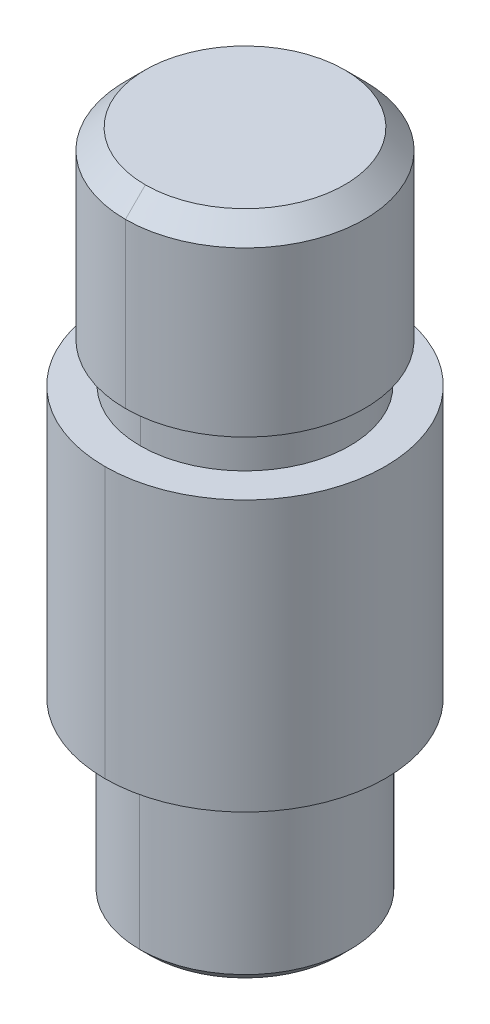
ISO-10303-21;
HEADER;
FILE_DESCRIPTION(('STEP AP214'),'2;1');
FILE_NAME('part.step','',(''),(''),'','','');
FILE_SCHEMA(('AUTOMOTIVE_DESIGN { 1 0 10303 214 1 1 1 1 }'));
ENDSEC;
DATA;
#1=APPLICATION_CONTEXT('core data for automotive mechanical design processes');
#2=APPLICATION_PROTOCOL_DEFINITION('international standard','automotive_design',2000,#1);
#3=PRODUCT_CONTEXT('',#1,'mechanical');
#4=PRODUCT('Part','Part','',(#3));
#5=PRODUCT_RELATED_PRODUCT_CATEGORY('part','',(#4));
#6=PRODUCT_DEFINITION_FORMATION('','',#4);
#7=PRODUCT_DEFINITION_CONTEXT('part definition',#1,'design');
#8=PRODUCT_DEFINITION('design','',#6,#7);
#9=PRODUCT_DEFINITION_SHAPE('','',#8);
#10=(LENGTH_UNIT() NAMED_UNIT(*) SI_UNIT(.MILLI.,.METRE.));
#11=(NAMED_UNIT(*) PLANE_ANGLE_UNIT() SI_UNIT($,.RADIAN.));
#12=(NAMED_UNIT(*) SI_UNIT($,.STERADIAN.) SOLID_ANGLE_UNIT());
#13=UNCERTAINTY_MEASURE_WITH_UNIT(LENGTH_MEASURE(1.E-05),#10,'distance_accuracy_value','');
#14=(GEOMETRIC_REPRESENTATION_CONTEXT(3) GLOBAL_UNCERTAINTY_ASSIGNED_CONTEXT((#13)) GLOBAL_UNIT_ASSIGNED_CONTEXT((#10,
#11,#12)) REPRESENTATION_CONTEXT('',''));
#15=CARTESIAN_POINT('',(0.,0.,0.));
#16=DIRECTION('',(0.,0.,1.));
#17=DIRECTION('',(1.,0.,0.));
#18=AXIS2_PLACEMENT_3D('',#15,#16,#17);
#19=CARTESIAN_POINT('',(0.,22.3865327371101,0.));
#20=DIRECTION('',(0.,1.,0.));
#21=DIRECTION('',(0.,0.,1.));
#22=AXIS2_PLACEMENT_3D('',#19,#20,#21);
#23=CYLINDRICAL_SURFACE('',#22,3.49999999999727);
#24=CARTESIAN_POINT('',(0.,14.9075247376742,0.));
#25=DIRECTION('',(0.,1.,0.));
#26=DIRECTION('',(0.,0.,1.));
#27=AXIS2_PLACEMENT_3D('',#24,#25,#26);
#28=CIRCLE('',#27,3.49999999999727);
#29=CARTESIAN_POINT('',(0.,14.9075247376742,3.49999999999727));
#30=VERTEX_POINT('',#29);
#31=CARTESIAN_POINT('',(0.,14.9075247376742,-3.49999999999727));
#32=VERTEX_POINT('',#31);
#33=EDGE_CURVE('E11',#30,#32,#28,.T.);
#34=ORIENTED_EDGE('',*,*,#33,.T.);
#35=DIRECTION('',(0.,1.,0.));
#36=VECTOR('',#35,1.);
#37=CARTESIAN_POINT('',(0.,22.3865327371101,-3.49999999999727));
#38=LINE('',#37,#36);
#39=CARTESIAN_POINT('',(0.,16.2408580710061,-3.49999999999727));
#40=VERTEX_POINT('',#39);
#41=EDGE_CURVE('E27',#32,#40,#38,.T.);
#42=ORIENTED_EDGE('',*,*,#41,.T.);
#43=CARTESIAN_POINT('',(0.,16.2408580710061,0.));
#44=DIRECTION('',(0.,1.,0.));
#45=DIRECTION('',(0.,0.,1.));
#46=AXIS2_PLACEMENT_3D('',#43,#44,#45);
#47=CIRCLE('',#46,3.49999999999727);
#48=CARTESIAN_POINT('',(0.,16.2408580710061,3.49999999999727));
#49=VERTEX_POINT('',#48);
#50=EDGE_CURVE('E180',#49,#40,#47,.T.);
#51=ORIENTED_EDGE('',*,*,#50,.F.);
#52=DIRECTION('',(0.,1.,0.));
#53=VECTOR('',#52,1.);
#54=CARTESIAN_POINT('',(0.,22.3865327371101,3.49999999999727));
#55=LINE('',#54,#53);
#56=EDGE_CURVE('E184',#30,#49,#55,.T.);
#57=ORIENTED_EDGE('',*,*,#56,.F.);
#58=EDGE_LOOP('',(#34,#42,#51,#57));
#59=FACE_BOUND('',#58,.T.);
#60=ADVANCED_FACE('F16',(#59),#23,.T.);
#61=CARTESIAN_POINT('',(0.,22.3865327371101,0.));
#62=DIRECTION('',(0.,1.,0.));
#63=DIRECTION('',(0.,0.,1.));
#64=AXIS2_PLACEMENT_3D('',#61,#62,#63);
#65=CYLINDRICAL_SURFACE('',#64,3.99999999999636);
#66=CARTESIAN_POINT('',(0.,16.2408580710061,0.));
#67=DIRECTION('',(0.,1.,0.));
#68=DIRECTION('',(0.,0.,1.));
#69=AXIS2_PLACEMENT_3D('',#66,#67,#68);
#70=CIRCLE('',#69,3.99999999999636);
#71=CARTESIAN_POINT('',(0.,16.2408580710061,3.99999999999636));
#72=VERTEX_POINT('',#71);
#73=CARTESIAN_POINT('',(0.,16.2408580710061,-3.99999999999636));
#74=VERTEX_POINT('',#73);
#75=EDGE_CURVE('E166',#72,#74,#70,.T.);
#76=ORIENTED_EDGE('',*,*,#75,.T.);
#77=DIRECTION('',(0.,1.,0.));
#78=VECTOR('',#77,1.);
#79=CARTESIAN_POINT('',(0.,22.3865327371101,-3.99999999999636));
#80=LINE('',#79,#78);
#81=CARTESIAN_POINT('',(0.,21.7198660704441,-3.99999999999636));
#82=VERTEX_POINT('',#81);
#83=EDGE_CURVE('E137',#74,#82,#80,.T.);
#84=ORIENTED_EDGE('',*,*,#83,.T.);
#85=CARTESIAN_POINT('',(0.,21.7198660704441,0.));
#86=DIRECTION('',(0.,1.,0.));
#87=DIRECTION('',(0.,0.,1.));
#88=AXIS2_PLACEMENT_3D('',#85,#86,#87);
#89=CIRCLE('',#88,3.99999999999636);
#90=CARTESIAN_POINT('',(0.,21.7198660704441,3.99999999999636));
#91=VERTEX_POINT('',#90);
#92=EDGE_CURVE('E138',#91,#82,#89,.T.);
#93=ORIENTED_EDGE('',*,*,#92,.F.);
#94=DIRECTION('',(0.,1.,0.));
#95=VECTOR('',#94,1.);
#96=CARTESIAN_POINT('',(0.,22.3865327371101,3.99999999999636));
#97=LINE('',#96,#95);
#98=EDGE_CURVE('E204',#72,#91,#97,.T.);
#99=ORIENTED_EDGE('',*,*,#98,.F.);
#100=EDGE_LOOP('',(#76,#84,#93,#99));
#101=FACE_BOUND('',#100,.T.);
#102=ADVANCED_FACE('F367',(#101),#65,.T.);
#103=CARTESIAN_POINT('',(0.,22.3865327371101,0.));
#104=DIRECTION('',(0.,-1.,0.));
#105=DIRECTION('',(0.,0.,-1.));
#106=AXIS2_PLACEMENT_3D('',#103,#104,#105);
#107=CONICAL_SURFACE('',#106,3.33333333333031,0.785398163397448);
#108=CARTESIAN_POINT('',(0.,22.3865327371101,0.));
#109=DIRECTION('',(0.,1.,0.));
#110=DIRECTION('',(0.,0.,1.));
#111=AXIS2_PLACEMENT_3D('',#108,#109,#110);
#112=CIRCLE('',#111,3.33333333333031);
#113=CARTESIAN_POINT('',(0.,22.3865327371101,3.33333333333031));
#114=VERTEX_POINT('',#113);
#115=CARTESIAN_POINT('',(0.,22.3865327371101,-3.33333333333031));
#116=VERTEX_POINT('',#115);
#117=EDGE_CURVE('E119',#114,#116,#112,.T.);
#118=ORIENTED_EDGE('',*,*,#117,.F.);
#119=DIRECTION('',(0.,-0.707106781186548,0.707106781186548));
#120=VECTOR('',#119,1.);
#121=CARTESIAN_POINT('',(0.,22.3865327371101,3.33333333333031));
#122=LINE('',#121,#120);
#123=EDGE_CURVE('E123',#114,#91,#122,.T.);
#124=ORIENTED_EDGE('',*,*,#123,.T.);
#125=ORIENTED_EDGE('',*,*,#92,.T.);
#126=DIRECTION('',(0.,-0.707106781186548,-0.707106781186548));
#127=VECTOR('',#126,1.);
#128=CARTESIAN_POINT('',(0.,22.3865327371101,-3.33333333333031));
#129=LINE('',#128,#127);
#130=EDGE_CURVE('E125',#116,#82,#129,.T.);
#131=ORIENTED_EDGE('',*,*,#130,.F.);
#132=EDGE_LOOP('',(#118,#124,#125,#131));
#133=FACE_BOUND('',#132,.T.);
#134=ADVANCED_FACE('F121',(#133),#107,.T.);
#135=CARTESIAN_POINT('',(0.,0.333333333333075,0.));
#136=DIRECTION('',(0.,1.,0.));
#137=DIRECTION('',(0.,0.,1.));
#138=AXIS2_PLACEMENT_3D('',#135,#136,#137);
#139=CONICAL_SURFACE('',#138,3.52329683966718,0.785398163397376);
#140=CARTESIAN_POINT('',(0.,0.,0.));
#141=DIRECTION('',(0.,1.,0.));
#142=DIRECTION('',(0.,0.,1.));
#143=AXIS2_PLACEMENT_3D('',#140,#141,#142);
#144=CIRCLE('',#143,3.18996350633415);
#145=CARTESIAN_POINT('',(0.,0.,3.18996350633415));
#146=VERTEX_POINT('',#145);
#147=CARTESIAN_POINT('',(0.,0.,-3.18996350633415));
#148=VERTEX_POINT('',#147);
#149=EDGE_CURVE('E157',#146,#148,#144,.T.);
#150=ORIENTED_EDGE('',*,*,#149,.T.);
#151=DIRECTION('',(0.,0.707106781186599,-0.707106781186496));
#152=VECTOR('',#151,1.);
#153=CARTESIAN_POINT('',(0.,0.333333333333075,-3.52329683966718));
#154=LINE('',#153,#152);
#155=CARTESIAN_POINT('',(0.,0.333333333333075,-3.52329683966718));
#156=VERTEX_POINT('',#155);
#157=EDGE_CURVE('E253',#148,#156,#154,.T.);
#158=ORIENTED_EDGE('',*,*,#157,.T.);
#159=CARTESIAN_POINT('',(0.,0.333333333333075,0.));
#160=DIRECTION('',(0.,1.,0.));
#161=DIRECTION('',(0.,0.,1.));
#162=AXIS2_PLACEMENT_3D('',#159,#160,#161);
#163=CIRCLE('',#162,3.52329683966718);
#164=CARTESIAN_POINT('',(0.,0.333333333333075,3.52329683966718));
#165=VERTEX_POINT('',#164);
#166=EDGE_CURVE('E202',#165,#156,#163,.T.);
#167=ORIENTED_EDGE('',*,*,#166,.F.);
#168=DIRECTION('',(0.,0.707106781186599,0.707106781186496));
#169=VECTOR('',#168,1.);
#170=CARTESIAN_POINT('',(0.,0.333333333333075,3.52329683966718));
#171=LINE('',#170,#169);
#172=EDGE_CURVE('E142',#146,#165,#171,.T.);
#173=ORIENTED_EDGE('',*,*,#172,.F.);
#174=EDGE_LOOP('',(#150,#158,#167,#173));
#175=FACE_BOUND('',#174,.T.);
#176=ADVANCED_FACE('F265',(#175),#139,.T.);
#177=CARTESIAN_POINT('',(0.,22.3865327371101,0.));
#178=DIRECTION('',(0.,1.,0.));
#179=DIRECTION('',(0.,0.,1.));
#180=AXIS2_PLACEMENT_3D('',#177,#178,#179);
#181=CYLINDRICAL_SURFACE('',#180,3.52329683966718);
#182=ORIENTED_EDGE('',*,*,#166,.T.);
#183=DIRECTION('',(0.,1.,0.));
#184=VECTOR('',#183,1.);
#185=CARTESIAN_POINT('',(0.,22.3865327371101,-3.52329683966718));
#186=LINE('',#185,#184);
#187=CARTESIAN_POINT('',(0.,5.04567816023155,-3.52329683966718));
#188=VERTEX_POINT('',#187);
#189=EDGE_CURVE('E198',#156,#188,#186,.T.);
#190=ORIENTED_EDGE('',*,*,#189,.T.);
#191=CARTESIAN_POINT('',(0.,5.04567816023155,0.));
#192=DIRECTION('',(0.,1.,0.));
#193=DIRECTION('',(0.,0.,1.));
#194=AXIS2_PLACEMENT_3D('',#191,#192,#193);
#195=CIRCLE('',#194,3.52329683966718);
#196=CARTESIAN_POINT('',(0.,5.04567816023155,3.52329683966718));
#197=VERTEX_POINT('',#196);
#198=EDGE_CURVE('E217',#197,#188,#195,.T.);
#199=ORIENTED_EDGE('',*,*,#198,.F.);
#200=DIRECTION('',(0.,1.,0.));
#201=VECTOR('',#200,1.);
#202=CARTESIAN_POINT('',(0.,22.3865327371101,3.52329683966718));
#203=LINE('',#202,#201);
#204=EDGE_CURVE('E175',#165,#197,#203,.T.);
#205=ORIENTED_EDGE('',*,*,#204,.F.);
#206=EDGE_LOOP('',(#182,#190,#199,#205));
#207=FACE_BOUND('',#206,.T.);
#208=ADVANCED_FACE('F379',(#207),#181,.T.);
#209=CARTESIAN_POINT('',(0.,5.38118173643853,0.));
#210=DIRECTION('',(0.,-1.,0.));
#211=DIRECTION('',(0.,0.,-1.));
#212=AXIS2_PLACEMENT_3D('',#209,#210,#211);
#213=CONICAL_SURFACE('',#212,3.37992701267058,0.403840212732483);
#214=CARTESIAN_POINT('',(0.,5.38118173643853,0.));
#215=DIRECTION('',(0.,1.,0.));
#216=DIRECTION('',(0.,0.,1.));
#217=AXIS2_PLACEMENT_3D('',#214,#215,#216);
#218=CIRCLE('',#217,3.37992701267058);
#219=CARTESIAN_POINT('',(0.,5.38118173643853,3.37992701267058));
#220=VERTEX_POINT('',#219);
#221=CARTESIAN_POINT('',(0.,5.38118173643853,-3.37992701267058));
#222=VERTEX_POINT('',#221);
#223=EDGE_CURVE('E154',#220,#222,#218,.T.);
#224=ORIENTED_EDGE('',*,*,#223,.F.);
#225=DIRECTION('',(0.,-0.91955875685953,0.392952532353407));
#226=VECTOR('',#225,1.);
#227=CARTESIAN_POINT('',(0.,5.38118173643853,3.37992701267058));
#228=LINE('',#227,#226);
#229=EDGE_CURVE('E20',#220,#197,#228,.T.);
#230=ORIENTED_EDGE('',*,*,#229,.T.);
#231=ORIENTED_EDGE('',*,*,#198,.T.);
#232=DIRECTION('',(0.,-0.91955875685953,-0.392952532353407));
#233=VECTOR('',#232,1.);
#234=CARTESIAN_POINT('',(0.,5.38118173643853,-3.37992701267058));
#235=LINE('',#234,#233);
#236=EDGE_CURVE('E162',#222,#188,#235,.T.);
#237=ORIENTED_EDGE('',*,*,#236,.F.);
#238=EDGE_LOOP('',(#224,#230,#231,#237));
#239=FACE_BOUND('',#238,.T.);
#240=ADVANCED_FACE('F376',(#239),#213,.T.);
#241=CARTESIAN_POINT('',(0.,22.3865327371101,0.));
#242=DIRECTION('',(0.,1.,0.));
#243=DIRECTION('',(0.,0.,1.));
#244=AXIS2_PLACEMENT_3D('',#241,#242,#243);
#245=CYLINDRICAL_SURFACE('',#244,3.37992701267058);
#246=ORIENTED_EDGE('',*,*,#223,.T.);
#247=DIRECTION('',(0.,1.,0.));
#248=VECTOR('',#247,1.);
#249=CARTESIAN_POINT('',(0.,22.3865327371101,-3.37992701267058));
#250=LINE('',#249,#248);
#251=CARTESIAN_POINT('',(0.,5.86575682221041,-3.37992701267058));
#252=VERTEX_POINT('',#251);
#253=EDGE_CURVE('E209',#222,#252,#250,.T.);
#254=ORIENTED_EDGE('',*,*,#253,.T.);
#255=CARTESIAN_POINT('',(0.,5.86575682221041,0.));
#256=DIRECTION('',(0.,1.,0.));
#257=DIRECTION('',(0.,0.,1.));
#258=AXIS2_PLACEMENT_3D('',#255,#256,#257);
#259=CIRCLE('',#258,3.37992701267058);
#260=CARTESIAN_POINT('',(0.,5.86575682221041,3.37992701267058));
#261=VERTEX_POINT('',#260);
#262=EDGE_CURVE('E197',#261,#252,#259,.T.);
#263=ORIENTED_EDGE('',*,*,#262,.F.);
#264=DIRECTION('',(0.,1.,0.));
#265=VECTOR('',#264,1.);
#266=CARTESIAN_POINT('',(0.,22.3865327371101,3.37992701267058));
#267=LINE('',#266,#265);
#268=EDGE_CURVE('E158',#220,#261,#267,.T.);
#269=ORIENTED_EDGE('',*,*,#268,.F.);
#270=EDGE_LOOP('',(#246,#254,#263,#269));
#271=FACE_BOUND('',#270,.T.);
#272=ADVANCED_FACE('F375',(#271),#245,.T.);
#273=CARTESIAN_POINT('',(0.,22.3865327371101,0.));
#274=DIRECTION('',(0.,1.,0.));
#275=DIRECTION('',(0.,0.,1.));
#276=AXIS2_PLACEMENT_3D('',#273,#274,#275);
#277=CYLINDRICAL_SURFACE('',#276,4.6899635063329);
#278=CARTESIAN_POINT('',(0.,5.86575682221052,0.));
#279=DIRECTION('',(0.,1.,0.));
#280=DIRECTION('',(0.,0.,1.));
#281=AXIS2_PLACEMENT_3D('',#278,#279,#280);
#282=CIRCLE('',#281,4.68996350633302);
#283=CARTESIAN_POINT('',(0.,5.86575682221052,4.68996350633302));
#284=VERTEX_POINT('',#283);
#285=CARTESIAN_POINT('',(0.,5.86575682221052,-4.68996350633302));
#286=VERTEX_POINT('',#285);
#287=EDGE_CURVE('E206',#284,#286,#282,.T.);
#288=ORIENTED_EDGE('',*,*,#287,.T.);
#289=DIRECTION('',(0.,1.,0.));
#290=VECTOR('',#289,1.);
#291=CARTESIAN_POINT('',(0.,22.3865327371101,-4.6899635063329));
#292=LINE('',#291,#290);
#293=CARTESIAN_POINT('',(0.,14.9075247376742,-4.68996350633279));
#294=VERTEX_POINT('',#293);
#295=EDGE_CURVE('E210',#286,#294,#292,.T.);
#296=ORIENTED_EDGE('',*,*,#295,.T.);
#297=CARTESIAN_POINT('',(0.,14.9075247376742,0.));
#298=DIRECTION('',(0.,1.,0.));
#299=DIRECTION('',(0.,0.,1.));
#300=AXIS2_PLACEMENT_3D('',#297,#298,#299);
#301=CIRCLE('',#300,4.68996350633279);
#302=CARTESIAN_POINT('',(0.,14.9075247376742,4.68996350633279));
#303=VERTEX_POINT('',#302);
#304=EDGE_CURVE('E171',#303,#294,#301,.T.);
#305=ORIENTED_EDGE('',*,*,#304,.F.);
#306=DIRECTION('',(0.,1.,0.));
#307=VECTOR('',#306,1.);
#308=CARTESIAN_POINT('',(0.,22.3865327371101,4.6899635063329));
#309=LINE('',#308,#307);
#310=EDGE_CURVE('E192',#284,#303,#309,.T.);
#311=ORIENTED_EDGE('',*,*,#310,.F.);
#312=EDGE_LOOP('',(#288,#296,#305,#311));
#313=FACE_BOUND('',#312,.T.);
#314=ADVANCED_FACE('F342',(#313),#277,.T.);
#315=CARTESIAN_POINT('',(0.,22.3865327371101,0.));
#316=DIRECTION('',(0.,1.,0.));
#317=DIRECTION('',(0.,0.,1.));
#318=AXIS2_PLACEMENT_3D('',#315,#316,#317);
#319=CYLINDRICAL_SURFACE('',#318,4.6899635063329);
#320=ORIENTED_EDGE('',*,*,#295,.F.);
#321=CARTESIAN_POINT('',(0.,5.86575682221052,0.));
#322=DIRECTION('',(0.,1.,0.));
#323=DIRECTION('',(0.,0.,1.));
#324=AXIS2_PLACEMENT_3D('',#321,#322,#323);
#325=CIRCLE('',#324,4.68996350633302);
#326=EDGE_CURVE('E196',#286,#284,#325,.T.);
#327=ORIENTED_EDGE('',*,*,#326,.T.);
#328=ORIENTED_EDGE('',*,*,#310,.T.);
#329=CARTESIAN_POINT('',(0.,14.9075247376742,0.));
#330=DIRECTION('',(0.,1.,0.));
#331=DIRECTION('',(0.,0.,1.));
#332=AXIS2_PLACEMENT_3D('',#329,#330,#331);
#333=CIRCLE('',#332,4.68996350633279);
#334=EDGE_CURVE('E167',#294,#303,#333,.T.);
#335=ORIENTED_EDGE('',*,*,#334,.F.);
#336=EDGE_LOOP('',(#320,#327,#328,#335));
#337=FACE_BOUND('',#336,.T.);
#338=ADVANCED_FACE('F321',(#337),#319,.T.);
#339=CARTESIAN_POINT('',(4.9710815785471E-13,5.86575682221047,0.));
#340=DIRECTION('',(0.,-1.,0.));
#341=DIRECTION('',(0.,0.,-1.));
#342=AXIS2_PLACEMENT_3D('',#339,#340,#341);
#343=PLANE('',#342);
#344=ORIENTED_EDGE('',*,*,#287,.F.);
#345=ORIENTED_EDGE('',*,*,#326,.F.);
#346=EDGE_LOOP('',(#344,#345));
#347=FACE_BOUND('',#346,.T.);
#348=ORIENTED_EDGE('',*,*,#262,.T.);
#349=CARTESIAN_POINT('',(0.,5.86575682221041,0.));
#350=DIRECTION('',(0.,1.,0.));
#351=DIRECTION('',(0.,0.,1.));
#352=AXIS2_PLACEMENT_3D('',#349,#350,#351);
#353=CIRCLE('',#352,3.37992701267058);
#354=EDGE_CURVE('E221',#252,#261,#353,.T.);
#355=ORIENTED_EDGE('',*,*,#354,.T.);
#356=EDGE_LOOP('',(#348,#355));
#357=FACE_BOUND('',#356,.T.);
#358=ADVANCED_FACE('F328',(#347,#357),#343,.T.);
#359=CARTESIAN_POINT('',(0.,22.3865327371101,0.));
#360=DIRECTION('',(0.,1.,0.));
#361=DIRECTION('',(0.,0.,1.));
#362=AXIS2_PLACEMENT_3D('',#359,#360,#361);
#363=CYLINDRICAL_SURFACE('',#362,3.37992701267058);
#364=ORIENTED_EDGE('',*,*,#253,.F.);
#365=CARTESIAN_POINT('',(0.,5.38118173643853,0.));
#366=DIRECTION('',(0.,1.,0.));
#367=DIRECTION('',(0.,0.,1.));
#368=AXIS2_PLACEMENT_3D('',#365,#366,#367);
#369=CIRCLE('',#368,3.37992701267058);
#370=EDGE_CURVE('E161',#222,#220,#369,.T.);
#371=ORIENTED_EDGE('',*,*,#370,.T.);
#372=ORIENTED_EDGE('',*,*,#268,.T.);
#373=ORIENTED_EDGE('',*,*,#354,.F.);
#374=EDGE_LOOP('',(#364,#371,#372,#373));
#375=FACE_BOUND('',#374,.T.);
#376=ADVANCED_FACE('F18',(#375),#363,.T.);
#377=CARTESIAN_POINT('',(0.,5.38118173643853,0.));
#378=DIRECTION('',(0.,-1.,0.));
#379=DIRECTION('',(0.,0.,-1.));
#380=AXIS2_PLACEMENT_3D('',#377,#378,#379);
#381=CONICAL_SURFACE('',#380,3.37992701267058,0.403840212732483);
#382=ORIENTED_EDGE('',*,*,#229,.F.);
#383=ORIENTED_EDGE('',*,*,#370,.F.);
#384=ORIENTED_EDGE('',*,*,#236,.T.);
#385=CARTESIAN_POINT('',(0.,5.04567816023155,0.));
#386=DIRECTION('',(0.,1.,0.));
#387=DIRECTION('',(0.,0.,1.));
#388=AXIS2_PLACEMENT_3D('',#385,#386,#387);
#389=CIRCLE('',#388,3.52329683966718);
#390=EDGE_CURVE('E187',#188,#197,#389,.T.);
#391=ORIENTED_EDGE('',*,*,#390,.T.);
#392=EDGE_LOOP('',(#382,#383,#384,#391));
#393=FACE_BOUND('',#392,.T.);
#394=ADVANCED_FACE('F383',(#393),#381,.T.);
#395=CARTESIAN_POINT('',(0.,22.3865327371101,0.));
#396=DIRECTION('',(0.,1.,0.));
#397=DIRECTION('',(0.,0.,1.));
#398=AXIS2_PLACEMENT_3D('',#395,#396,#397);
#399=CYLINDRICAL_SURFACE('',#398,3.52329683966718);
#400=ORIENTED_EDGE('',*,*,#189,.F.);
#401=CARTESIAN_POINT('',(0.,0.333333333333075,0.));
#402=DIRECTION('',(0.,1.,0.));
#403=DIRECTION('',(0.,0.,1.));
#404=AXIS2_PLACEMENT_3D('',#401,#402,#403);
#405=CIRCLE('',#404,3.52329683966718);
#406=EDGE_CURVE('E191',#156,#165,#405,.T.);
#407=ORIENTED_EDGE('',*,*,#406,.T.);
#408=ORIENTED_EDGE('',*,*,#204,.T.);
#409=ORIENTED_EDGE('',*,*,#390,.F.);
#410=EDGE_LOOP('',(#400,#407,#408,#409));
#411=FACE_BOUND('',#410,.T.);
#412=ADVANCED_FACE('F381',(#411),#399,.T.);
#413=CARTESIAN_POINT('',(0.,0.333333333333075,0.));
#414=DIRECTION('',(0.,1.,0.));
#415=DIRECTION('',(0.,0.,1.));
#416=AXIS2_PLACEMENT_3D('',#413,#414,#415);
#417=CONICAL_SURFACE('',#416,3.52329683966718,0.785398163397376);
#418=ORIENTED_EDGE('',*,*,#157,.F.);
#419=CARTESIAN_POINT('',(0.,0.,0.));
#420=DIRECTION('',(0.,1.,0.));
#421=DIRECTION('',(0.,0.,1.));
#422=AXIS2_PLACEMENT_3D('',#419,#420,#421);
#423=CIRCLE('',#422,3.18996350633415);
#424=EDGE_CURVE('E150',#148,#146,#423,.T.);
#425=ORIENTED_EDGE('',*,*,#424,.T.);
#426=ORIENTED_EDGE('',*,*,#172,.T.);
#427=ORIENTED_EDGE('',*,*,#406,.F.);
#428=EDGE_LOOP('',(#418,#425,#426,#427));
#429=FACE_BOUND('',#428,.T.);
#430=ADVANCED_FACE('F270',(#429),#417,.T.);
#431=CARTESIAN_POINT('',(0.,0.,0.));
#432=DIRECTION('',(0.,-1.,0.));
#433=DIRECTION('',(0.,0.,-1.));
#434=AXIS2_PLACEMENT_3D('',#431,#432,#433);
#435=PLANE('',#434);
#436=ORIENTED_EDGE('',*,*,#149,.F.);
#437=ORIENTED_EDGE('',*,*,#424,.F.);
#438=EDGE_LOOP('',(#436,#437));
#439=FACE_BOUND('',#438,.T.);
#440=ADVANCED_FACE('F388',(#439),#435,.T.);
#441=CARTESIAN_POINT('',(0.,22.3865327371101,0.));
#442=DIRECTION('',(0.,-1.,0.));
#443=DIRECTION('',(0.,0.,-1.));
#444=AXIS2_PLACEMENT_3D('',#441,#442,#443);
#445=PLANE('',#444);
#446=CARTESIAN_POINT('',(0.,22.3865327371101,0.));
#447=DIRECTION('',(0.,1.,0.));
#448=DIRECTION('',(0.,0.,1.));
#449=AXIS2_PLACEMENT_3D('',#446,#447,#448);
#450=CIRCLE('',#449,3.33333333333031);
#451=EDGE_CURVE('E130',#116,#114,#450,.T.);
#452=ORIENTED_EDGE('',*,*,#451,.T.);
#453=ORIENTED_EDGE('',*,*,#117,.T.);
#454=EDGE_LOOP('',(#452,#453));
#455=FACE_BOUND('',#454,.T.);
#456=ADVANCED_FACE('F140',(#455),#445,.F.);
#457=CARTESIAN_POINT('',(0.,22.3865327371101,0.));
#458=DIRECTION('',(0.,-1.,0.));
#459=DIRECTION('',(0.,0.,-1.));
#460=AXIS2_PLACEMENT_3D('',#457,#458,#459);
#461=CONICAL_SURFACE('',#460,3.33333333333031,0.785398163397448);
#462=ORIENTED_EDGE('',*,*,#123,.F.);
#463=ORIENTED_EDGE('',*,*,#451,.F.);
#464=ORIENTED_EDGE('',*,*,#130,.T.);
#465=CARTESIAN_POINT('',(0.,21.7198660704441,0.));
#466=DIRECTION('',(0.,1.,0.));
#467=DIRECTION('',(0.,0.,1.));
#468=AXIS2_PLACEMENT_3D('',#465,#466,#467);
#469=CIRCLE('',#468,3.99999999999636);
#470=EDGE_CURVE('E135',#82,#91,#469,.T.);
#471=ORIENTED_EDGE('',*,*,#470,.T.);
#472=EDGE_LOOP('',(#462,#463,#464,#471));
#473=FACE_BOUND('',#472,.T.);
#474=ADVANCED_FACE('F133',(#473),#461,.T.);
#475=CARTESIAN_POINT('',(0.,22.3865327371101,0.));
#476=DIRECTION('',(0.,1.,0.));
#477=DIRECTION('',(0.,0.,1.));
#478=AXIS2_PLACEMENT_3D('',#475,#476,#477);
#479=CYLINDRICAL_SURFACE('',#478,3.99999999999636);
#480=ORIENTED_EDGE('',*,*,#83,.F.);
#481=CARTESIAN_POINT('',(0.,16.2408580710061,0.));
#482=DIRECTION('',(0.,1.,0.));
#483=DIRECTION('',(0.,0.,1.));
#484=AXIS2_PLACEMENT_3D('',#481,#482,#483);
#485=CIRCLE('',#484,3.99999999999636);
#486=EDGE_CURVE('E230',#74,#72,#485,.T.);
#487=ORIENTED_EDGE('',*,*,#486,.T.);
#488=ORIENTED_EDGE('',*,*,#98,.T.);
#489=ORIENTED_EDGE('',*,*,#470,.F.);
#490=EDGE_LOOP('',(#480,#487,#488,#489));
#491=FACE_BOUND('',#490,.T.);
#492=ADVANCED_FACE('F354',(#491),#479,.T.);
#493=CARTESIAN_POINT('',(0.,16.2408580710061,0.));
#494=DIRECTION('',(0.,-1.,0.));
#495=DIRECTION('',(0.,0.,-1.));
#496=AXIS2_PLACEMENT_3D('',#493,#494,#495);
#497=PLANE('',#496);
#498=ORIENTED_EDGE('',*,*,#75,.F.);
#499=ORIENTED_EDGE('',*,*,#486,.F.);
#500=EDGE_LOOP('',(#498,#499));
#501=FACE_BOUND('',#500,.T.);
#502=ORIENTED_EDGE('',*,*,#50,.T.);
#503=CARTESIAN_POINT('',(0.,16.2408580710061,0.));
#504=DIRECTION('',(0.,1.,0.));
#505=DIRECTION('',(0.,0.,1.));
#506=AXIS2_PLACEMENT_3D('',#503,#504,#505);
#507=CIRCLE('',#506,3.49999999999727);
#508=EDGE_CURVE('E176',#40,#49,#507,.T.);
#509=ORIENTED_EDGE('',*,*,#508,.T.);
#510=EDGE_LOOP('',(#502,#509));
#511=FACE_BOUND('',#510,.T.);
#512=ADVANCED_FACE('F352',(#501,#511),#497,.T.);
#513=CARTESIAN_POINT('',(0.,22.3865327371101,0.));
#514=DIRECTION('',(0.,1.,0.));
#515=DIRECTION('',(0.,0.,1.));
#516=AXIS2_PLACEMENT_3D('',#513,#514,#515);
#517=CYLINDRICAL_SURFACE('',#516,3.49999999999727);
#518=ORIENTED_EDGE('',*,*,#41,.F.);
#519=CARTESIAN_POINT('',(0.,14.9075247376742,0.));
#520=DIRECTION('',(0.,1.,0.));
#521=DIRECTION('',(0.,0.,1.));
#522=AXIS2_PLACEMENT_3D('',#519,#520,#521);
#523=CIRCLE('',#522,3.49999999999727);
#524=EDGE_CURVE('E181',#32,#30,#523,.T.);
#525=ORIENTED_EDGE('',*,*,#524,.T.);
#526=ORIENTED_EDGE('',*,*,#56,.T.);
#527=ORIENTED_EDGE('',*,*,#508,.F.);
#528=EDGE_LOOP('',(#518,#525,#526,#527));
#529=FACE_BOUND('',#528,.T.);
#530=ADVANCED_FACE('F347',(#529),#517,.T.);
#531=CARTESIAN_POINT('',(0.,14.9075247376742,0.));
#532=DIRECTION('',(0.,1.,0.));
#533=DIRECTION('',(1.,0.,0.));
#534=AXIS2_PLACEMENT_3D('',#531,#532,#533);
#535=PLANE('',#534);
#536=ORIENTED_EDGE('',*,*,#304,.T.);
#537=ORIENTED_EDGE('',*,*,#334,.T.);
#538=EDGE_LOOP('',(#536,#537));
#539=FACE_BOUND('',#538,.T.);
#540=ORIENTED_EDGE('',*,*,#33,.F.);
#541=ORIENTED_EDGE('',*,*,#524,.F.);
#542=EDGE_LOOP('',(#540,#541));
#543=FACE_BOUND('',#542,.T.);
#544=ADVANCED_FACE('F344',(#539,#543),#535,.T.);
#545=CLOSED_SHELL('',(#60,#102,#134,#176,#208,#240,#272,#314,#338,#358,#376,#394,#412,#430,#440,
#456,#474,#492,#512,#530,#544));
#546=MANIFOLD_SOLID_BREP('B1',#545);
#547=ADVANCED_BREP_SHAPE_REPRESENTATION('',(#18,#546),#14);
#548=SHAPE_DEFINITION_REPRESENTATION(#9,#547);
ENDSEC;
END-ISO-10303-21;
